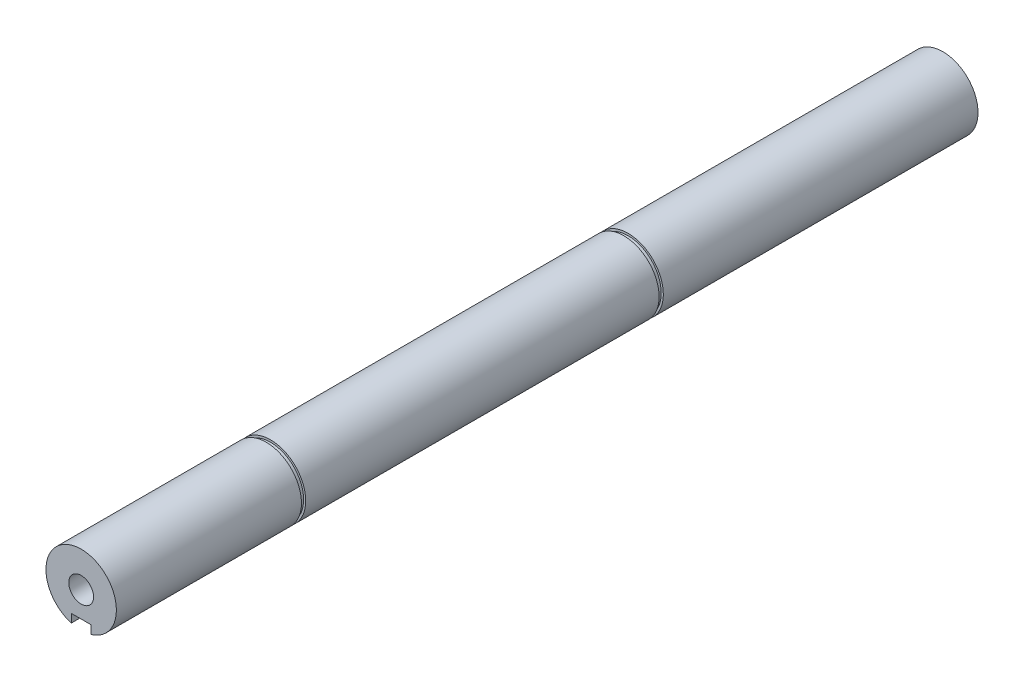
ISO-10303-21;
HEADER;
FILE_DESCRIPTION(('STEP AP214'),'2;1');
FILE_NAME('part.step','',(''),(''),'','','');
FILE_SCHEMA(('AUTOMOTIVE_DESIGN { 1 0 10303 214 1 1 1 1 }'));
ENDSEC;
DATA;
#1=APPLICATION_CONTEXT('core data for automotive mechanical design processes');
#2=APPLICATION_PROTOCOL_DEFINITION('international standard','automotive_design',2000,#1);
#3=PRODUCT_CONTEXT('',#1,'mechanical');
#4=PRODUCT('Part','Part','',(#3));
#5=PRODUCT_RELATED_PRODUCT_CATEGORY('part','',(#4));
#6=PRODUCT_DEFINITION_FORMATION('','',#4);
#7=PRODUCT_DEFINITION_CONTEXT('part definition',#1,'design');
#8=PRODUCT_DEFINITION('design','',#6,#7);
#9=PRODUCT_DEFINITION_SHAPE('','',#8);
#10=(LENGTH_UNIT() NAMED_UNIT(*) SI_UNIT(.MILLI.,.METRE.));
#11=(NAMED_UNIT(*) PLANE_ANGLE_UNIT() SI_UNIT($,.RADIAN.));
#12=(NAMED_UNIT(*) SI_UNIT($,.STERADIAN.) SOLID_ANGLE_UNIT());
#13=UNCERTAINTY_MEASURE_WITH_UNIT(LENGTH_MEASURE(1.E-05),#10,'distance_accuracy_value','');
#14=(GEOMETRIC_REPRESENTATION_CONTEXT(3) GLOBAL_UNCERTAINTY_ASSIGNED_CONTEXT((#13)) GLOBAL_UNIT_ASSIGNED_CONTEXT((#10,
#11,#12)) REPRESENTATION_CONTEXT('',''));
#15=CARTESIAN_POINT('',(0.,0.,0.));
#16=DIRECTION('',(0.,0.,1.));
#17=DIRECTION('',(1.,0.,0.));
#18=AXIS2_PLACEMENT_3D('',#15,#16,#17);
#19=CARTESIAN_POINT('',(0.,0.,0.));
#20=DIRECTION('',(0.,0.,0.999999999999996));
#21=DIRECTION('',(1.,0.,0.));
#22=AXIS2_PLACEMENT_3D('',#19,#20,#21);
#23=PLANE('',#22);
#24=CARTESIAN_POINT('',(0.,0.,0.));
#25=DIRECTION('',(0.,0.,0.999999999999996));
#26=DIRECTION('',(1.,0.,0.));
#27=AXIS2_PLACEMENT_3D('',#24,#25,#26);
#28=CIRCLE('',#27,4.39999999999999);
#29=CARTESIAN_POINT('',(4.39999999999999,0.,0.));
#30=VERTEX_POINT('',#29);
#31=EDGE_CURVE('E424',#30,#30,#28,.T.);
#32=ORIENTED_EDGE('',*,*,#31,.F.);
#33=EDGE_LOOP('',(#32));
#34=FACE_BOUND('',#33,.T.);
#35=DIRECTION('',(0.,-1.,0.));
#36=VECTOR('',#35,1.);
#37=CARTESIAN_POINT('',(-3.49999999999415,-9.00000000000115,0.));
#38=LINE('',#37,#36);
#39=CARTESIAN_POINT('',(-3.49999999999415,-9.00000000000115,0.));
#40=VERTEX_POINT('',#39);
#41=CARTESIAN_POINT('',(-3.49999999999417,-12.0000000000021,0.));
#42=VERTEX_POINT('',#41);
#43=EDGE_CURVE('E202',#40,#42,#38,.T.);
#44=ORIENTED_EDGE('',*,*,#43,.F.);
#45=DIRECTION('',(-1.,0.,0.));
#46=VECTOR('',#45,1.);
#47=CARTESIAN_POINT('',(3.49999999999429,-9.00000000000122,0.));
#48=LINE('',#47,#46);
#49=CARTESIAN_POINT('',(3.49999999999429,-9.00000000000122,0.));
#50=VERTEX_POINT('',#49);
#51=EDGE_CURVE('E199',#50,#40,#48,.T.);
#52=ORIENTED_EDGE('',*,*,#51,.F.);
#53=DIRECTION('',(0.,1.,0.));
#54=VECTOR('',#53,1.);
#55=CARTESIAN_POINT('',(3.49999999999415,-16.0000000000028,0.));
#56=LINE('',#55,#54);
#57=CARTESIAN_POINT('',(3.49999999999404,-12.0000000000019,0.));
#58=VERTEX_POINT('',#57);
#59=EDGE_CURVE('E184',#58,#50,#56,.T.);
#60=ORIENTED_EDGE('',*,*,#59,.F.);
#61=CARTESIAN_POINT('',(0.,0.,0.));
#62=DIRECTION('',(0.,0.,0.999999999999996));
#63=DIRECTION('',(1.,0.,0.));
#64=AXIS2_PLACEMENT_3D('',#61,#62,#63);
#65=CIRCLE('',#64,12.5);
#66=EDGE_CURVE('E210',#58,#42,#65,.T.);
#67=ORIENTED_EDGE('',*,*,#66,.T.);
#68=EDGE_LOOP('',(#44,#52,#60,#67));
#69=FACE_BOUND('',#68,.T.);
#70=ADVANCED_FACE('F52',(#34,#69),#23,.T.);
#71=CARTESIAN_POINT('',(0.,-1.11022302462516E-13,-341.191648507216));
#72=DIRECTION('',(0.,0.,0.999999999999996));
#73=DIRECTION('',(1.,0.,0.));
#74=AXIS2_PLACEMENT_3D('',#71,#72,#73);
#75=CYLINDRICAL_SURFACE('',#74,12.5);
#76=CARTESIAN_POINT('',(0.,0.,-65.7000000000001));
#77=DIRECTION('',(0.,0.,0.999999999999996));
#78=DIRECTION('',(1.,0.,0.));
#79=AXIS2_PLACEMENT_3D('',#76,#77,#78);
#80=CIRCLE('',#79,12.4999999999999);
#81=CARTESIAN_POINT('',(12.5,0.,-65.7000000000001));
#82=VERTEX_POINT('',#81);
#83=EDGE_CURVE('E402',#82,#82,#80,.T.);
#84=ORIENTED_EDGE('',*,*,#83,.T.);
#85=EDGE_LOOP('',(#84));
#86=FACE_BOUND('',#85,.T.);
#87=DIRECTION('',(0.,0.,0.999999999999996));
#88=VECTOR('',#87,1.);
#89=CARTESIAN_POINT('',(-3.49999999999398,-12.000000000002,-341.191648507216));
#90=LINE('',#89,#88);
#91=CARTESIAN_POINT('',(-3.49999999999417,-12.000000000002,-31.8000000000001));
#92=VERTEX_POINT('',#91);
#93=EDGE_CURVE('E157',#42,#92,#90,.F.);
#94=ORIENTED_EDGE('',*,*,#93,.F.);
#95=ORIENTED_EDGE('',*,*,#66,.F.);
#96=DIRECTION('',(0.,0.,0.999999999999996));
#97=VECTOR('',#96,1.);
#98=CARTESIAN_POINT('',(3.49999999999415,-12.0000000000018,-341.191648507216));
#99=LINE('',#98,#97);
#100=CARTESIAN_POINT('',(3.49999999999415,-12.0000000000017,-31.8000000000001));
#101=VERTEX_POINT('',#100);
#102=EDGE_CURVE('E160',#101,#58,#99,.T.);
#103=ORIENTED_EDGE('',*,*,#102,.F.);
#104=CARTESIAN_POINT('',(0.,0.,-31.8000000000001));
#105=DIRECTION('',(0.,0.,0.999999999999996));
#106=DIRECTION('',(1.,0.,0.));
#107=AXIS2_PLACEMENT_3D('',#104,#105,#106);
#108=CIRCLE('',#107,12.5);
#109=EDGE_CURVE('E214',#101,#92,#108,.F.);
#110=ORIENTED_EDGE('',*,*,#109,.T.);
#111=EDGE_LOOP('',(#94,#95,#103,#110));
#112=FACE_BOUND('',#111,.T.);
#113=ADVANCED_FACE('F228',(#86,#112),#75,.T.);
#114=CARTESIAN_POINT('',(-3.49999999999409,-9.00000000000109,-41.6994949366046));
#115=DIRECTION('',(-1.,0.,0.));
#116=DIRECTION('',(0.,0.,0.999999999999996));
#117=AXIS2_PLACEMENT_3D('',#114,#115,#116);
#118=PLANE('',#117);
#119=ORIENTED_EDGE('',*,*,#93,.T.);
#120=DIRECTION('',(0.,1.,0.));
#121=VECTOR('',#120,1.);
#122=CARTESIAN_POINT('',(-3.49999999999409,-9.00000000000109,-31.8000000000001));
#123=LINE('',#122,#121);
#124=CARTESIAN_POINT('',(-3.49999999999409,-9.00000000000109,-31.8000000000001));
#125=VERTEX_POINT('',#124);
#126=EDGE_CURVE('E75',#92,#125,#123,.T.);
#127=ORIENTED_EDGE('',*,*,#126,.T.);
#128=DIRECTION('',(0.,0.,0.999999999999996));
#129=VECTOR('',#128,1.);
#130=CARTESIAN_POINT('',(-3.49999999999409,-9.00000000000109,-41.6994949366046));
#131=LINE('',#130,#129);
#132=EDGE_CURVE('E195',#125,#40,#131,.T.);
#133=ORIENTED_EDGE('',*,*,#132,.T.);
#134=ORIENTED_EDGE('',*,*,#43,.T.);
#135=EDGE_LOOP('',(#119,#127,#133,#134));
#136=FACE_BOUND('',#135,.T.);
#137=ADVANCED_FACE('F230',(#136),#118,.F.);
#138=CARTESIAN_POINT('',(3.49999999999434,-9.00000000000123,-41.6994949366046));
#139=DIRECTION('',(0.,1.,0.));
#140=DIRECTION('',(0.,0.,0.999999999999996));
#141=AXIS2_PLACEMENT_3D('',#138,#139,#140);
#142=PLANE('',#141);
#143=DIRECTION('',(1.,0.,0.));
#144=VECTOR('',#143,1.);
#145=CARTESIAN_POINT('',(3.49999999999431,-9.0000000000012,-31.8000000000001));
#146=LINE('',#145,#144);
#147=CARTESIAN_POINT('',(3.49999999999431,-9.0000000000012,-31.8000000000001));
#148=VERTEX_POINT('',#147);
#149=EDGE_CURVE('E193',#125,#148,#146,.T.);
#150=ORIENTED_EDGE('',*,*,#149,.T.);
#151=DIRECTION('',(0.,0.,0.999999999999996));
#152=VECTOR('',#151,1.);
#153=CARTESIAN_POINT('',(3.49999999999434,-9.00000000000123,-41.6994949366046));
#154=LINE('',#153,#152);
#155=EDGE_CURVE('E204',#148,#50,#154,.T.);
#156=ORIENTED_EDGE('',*,*,#155,.T.);
#157=ORIENTED_EDGE('',*,*,#51,.T.);
#158=ORIENTED_EDGE('',*,*,#132,.F.);
#159=EDGE_LOOP('',(#150,#156,#157,#158));
#160=FACE_BOUND('',#159,.T.);
#161=ADVANCED_FACE('F233',(#160),#142,.F.);
#162=CARTESIAN_POINT('',(3.49999999999412,-16.0000000000028,-41.6994949366046));
#163=DIRECTION('',(1.,0.,0.));
#164=DIRECTION('',(0.,0.,-0.999999999999996));
#165=AXIS2_PLACEMENT_3D('',#162,#163,#164);
#166=PLANE('',#165);
#167=ORIENTED_EDGE('',*,*,#102,.T.);
#168=ORIENTED_EDGE('',*,*,#59,.T.);
#169=ORIENTED_EDGE('',*,*,#155,.F.);
#170=DIRECTION('',(0.,-1.,0.));
#171=VECTOR('',#170,1.);
#172=CARTESIAN_POINT('',(3.49999999999409,-16.0000000000029,-31.8000000000001));
#173=LINE('',#172,#171);
#174=EDGE_CURVE('E197',#148,#101,#173,.T.);
#175=ORIENTED_EDGE('',*,*,#174,.T.);
#176=EDGE_LOOP('',(#167,#168,#169,#175));
#177=FACE_BOUND('',#176,.T.);
#178=ADVANCED_FACE('F219',(#177),#166,.F.);
#179=CARTESIAN_POINT('',(1.74027459109993E-11,-12.5000000000011,-31.8000000000001));
#180=DIRECTION('',(0.,0.,0.999999999999996));
#181=DIRECTION('',(-1.,0.,0.));
#182=AXIS2_PLACEMENT_3D('',#179,#180,#181);
#183=PLANE('',#182);
#184=ORIENTED_EDGE('',*,*,#174,.F.);
#185=ORIENTED_EDGE('',*,*,#149,.F.);
#186=ORIENTED_EDGE('',*,*,#126,.F.);
#187=ORIENTED_EDGE('',*,*,#109,.F.);
#188=EDGE_LOOP('',(#184,#185,#186,#187));
#189=FACE_BOUND('',#188,.T.);
#190=ADVANCED_FACE('F234',(#189),#183,.T.);
#191=CARTESIAN_POINT('',(0.,0.,-26.25));
#192=DIRECTION('',(0.,0.,0.999999999999996));
#193=DIRECTION('',(1.,0.,0.));
#194=AXIS2_PLACEMENT_3D('',#191,#192,#193);
#195=CONICAL_SURFACE('',#194,4.39999999999999,1.02974425867665);
#196=CARTESIAN_POINT('',(0.,0.,-28.8937867237212));
#197=VERTEX_POINT('',#196);
#198=VERTEX_LOOP('',#197);
#199=FACE_BOUND('',#198,.T.);
#200=CARTESIAN_POINT('',(0.,0.,-26.25));
#201=DIRECTION('',(0.,0.,0.999999999999996));
#202=DIRECTION('',(1.,0.,0.));
#203=AXIS2_PLACEMENT_3D('',#200,#201,#202);
#204=CIRCLE('',#203,4.39999999999999);
#205=CARTESIAN_POINT('',(4.39999999999999,0.,-26.25));
#206=VERTEX_POINT('',#205);
#207=EDGE_CURVE('E180',#206,#206,#204,.T.);
#208=ORIENTED_EDGE('',*,*,#207,.T.);
#209=EDGE_LOOP('',(#208));
#210=FACE_BOUND('',#209,.T.);
#211=ADVANCED_FACE('F236',(#199,#210),#195,.F.);
#212=CARTESIAN_POINT('',(0.,0.,0.));
#213=DIRECTION('',(0.,0.,0.999999999999996));
#214=DIRECTION('',(1.,0.,0.));
#215=AXIS2_PLACEMENT_3D('',#212,#213,#214);
#216=CYLINDRICAL_SURFACE('',#215,4.39999999999999);
#217=ORIENTED_EDGE('',*,*,#207,.F.);
#218=EDGE_LOOP('',(#217));
#219=FACE_BOUND('',#218,.T.);
#220=ORIENTED_EDGE('',*,*,#31,.T.);
#221=EDGE_LOOP('',(#220));
#222=FACE_BOUND('',#221,.T.);
#223=ADVANCED_FACE('F242',(#219,#222),#216,.F.);
#224=CARTESIAN_POINT('',(0.,12.5,-67.2000000000001));
#225=DIRECTION('',(0.,0.,-0.999999999999996));
#226=DIRECTION('',(-1.,0.,0.));
#227=AXIS2_PLACEMENT_3D('',#224,#225,#226);
#228=PLANE('',#227);
#229=CARTESIAN_POINT('',(0.,0.,-67.2000000000001));
#230=DIRECTION('',(0.,0.,0.999999999999996));
#231=DIRECTION('',(1.,0.,0.));
#232=AXIS2_PLACEMENT_3D('',#229,#230,#231);
#233=CIRCLE('',#232,11.75);
#234=CARTESIAN_POINT('',(11.75,0.,-67.2000000000001));
#235=VERTEX_POINT('',#234);
#236=EDGE_CURVE('E407',#235,#235,#233,.T.);
#237=ORIENTED_EDGE('',*,*,#236,.F.);
#238=EDGE_LOOP('',(#237));
#239=FACE_BOUND('',#238,.T.);
#240=CARTESIAN_POINT('',(0.,0.,-67.2000000000001));
#241=DIRECTION('',(0.,0.,0.999999999999996));
#242=DIRECTION('',(1.,0.,0.));
#243=AXIS2_PLACEMENT_3D('',#240,#241,#242);
#244=CIRCLE('',#243,12.5);
#245=CARTESIAN_POINT('',(12.5,0.,-67.2000000000001));
#246=VERTEX_POINT('',#245);
#247=EDGE_CURVE('E399',#246,#246,#244,.T.);
#248=ORIENTED_EDGE('',*,*,#247,.T.);
#249=EDGE_LOOP('',(#248));
#250=FACE_BOUND('',#249,.T.);
#251=ADVANCED_FACE('F296',(#239,#250),#228,.F.);
#252=CARTESIAN_POINT('',(0.,-1.94289029309402E-13,999.999999999996));
#253=DIRECTION('',(0.,0.,0.999999999999996));
#254=DIRECTION('',(1.,0.,0.));
#255=AXIS2_PLACEMENT_3D('',#252,#253,#254);
#256=CYLINDRICAL_SURFACE('',#255,11.75);
#257=CARTESIAN_POINT('',(0.,0.,-65.7000000000001));
#258=DIRECTION('',(0.,0.,0.999999999999996));
#259=DIRECTION('',(1.,0.,0.));
#260=AXIS2_PLACEMENT_3D('',#257,#258,#259);
#261=CIRCLE('',#260,11.75);
#262=CARTESIAN_POINT('',(11.75,0.,-65.7000000000001));
#263=VERTEX_POINT('',#262);
#264=EDGE_CURVE('E410',#263,#263,#261,.T.);
#265=ORIENTED_EDGE('',*,*,#264,.F.);
#266=EDGE_LOOP('',(#265));
#267=FACE_BOUND('',#266,.T.);
#268=ORIENTED_EDGE('',*,*,#236,.T.);
#269=EDGE_LOOP('',(#268));
#270=FACE_BOUND('',#269,.T.);
#271=ADVANCED_FACE('F357',(#267,#270),#256,.T.);
#272=CARTESIAN_POINT('',(0.,11.75,-65.7000000000001));
#273=DIRECTION('',(0.,0.,0.999999999999996));
#274=DIRECTION('',(1.,0.,0.));
#275=AXIS2_PLACEMENT_3D('',#272,#273,#274);
#276=PLANE('',#275);
#277=ORIENTED_EDGE('',*,*,#83,.F.);
#278=EDGE_LOOP('',(#277));
#279=FACE_BOUND('',#278,.T.);
#280=ORIENTED_EDGE('',*,*,#264,.T.);
#281=EDGE_LOOP('',(#280));
#282=FACE_BOUND('',#281,.T.);
#283=ADVANCED_FACE('F348',(#279,#282),#276,.F.);
#284=ORIENTED_EDGE('',*,*,#247,.F.);
#285=EDGE_LOOP('',(#284));
#286=FACE_BOUND('',#285,.T.);
#287=CARTESIAN_POINT('',(1.94289029309402E-13,0.,-192.636309447889));
#288=DIRECTION('',(0.,0.,0.999999999999996));
#289=DIRECTION('',(1.,0.,0.));
#290=AXIS2_PLACEMENT_3D('',#287,#288,#289);
#291=CIRCLE('',#290,12.5);
#292=CARTESIAN_POINT('',(12.5000000000002,0.,-192.636309447889));
#293=VERTEX_POINT('',#292);
#294=EDGE_CURVE('E145',#293,#293,#291,.T.);
#295=ORIENTED_EDGE('',*,*,#294,.T.);
#296=EDGE_LOOP('',(#295));
#297=FACE_BOUND('',#296,.T.);
#298=ADVANCED_FACE('F255',(#286,#297),#75,.T.);
#299=CARTESIAN_POINT('',(0.,11.75,-194.136309447889));
#300=DIRECTION('',(0.,0.,0.999999999999996));
#301=DIRECTION('',(1.,0.,0.));
#302=AXIS2_PLACEMENT_3D('',#299,#300,#301);
#303=PLANE('',#302);
#304=DIRECTION('',(0.,-1.,0.));
#305=VECTOR('',#304,1.);
#306=CARTESIAN_POINT('',(3.49999999999431,-9.00000000000119,-194.136309447889));
#307=LINE('',#306,#305);
#308=CARTESIAN_POINT('',(3.4999999999942,-11.2166171370894,-194.136309447889));
#309=VERTEX_POINT('',#308);
#310=CARTESIAN_POINT('',(3.49999999999412,-12.0000000000018,-194.136309447889));
#311=VERTEX_POINT('',#310);
#312=EDGE_CURVE('E139',#309,#311,#307,.T.);
#313=ORIENTED_EDGE('',*,*,#312,.T.);
#314=CARTESIAN_POINT('',(1.94289029309402E-13,0.,-194.136309447889));
#315=DIRECTION('',(0.,0.,0.999999999999996));
#316=DIRECTION('',(1.,0.,0.));
#317=AXIS2_PLACEMENT_3D('',#314,#315,#316);
#318=CIRCLE('',#317,12.4999999999999);
#319=CARTESIAN_POINT('',(-3.49999999999415,-12.0000000000019,-194.136309447889));
#320=VERTEX_POINT('',#319);
#321=EDGE_CURVE('E134',#311,#320,#318,.T.);
#322=ORIENTED_EDGE('',*,*,#321,.T.);
#323=DIRECTION('',(0.,1.,0.));
#324=VECTOR('',#323,1.);
#325=CARTESIAN_POINT('',(-3.49999999999401,-16.0000000000028,-194.136309447889));
#326=LINE('',#325,#324);
#327=CARTESIAN_POINT('',(-3.49999999999412,-11.2166171370891,-194.136309447889));
#328=VERTEX_POINT('',#327);
#329=EDGE_CURVE('E13',#320,#328,#326,.T.);
#330=ORIENTED_EDGE('',*,*,#329,.T.);
#331=CARTESIAN_POINT('',(1.94289029309402E-13,0.,-194.136309447889));
#332=DIRECTION('',(0.,0.,0.999999999999996));
#333=DIRECTION('',(1.,0.,0.));
#334=AXIS2_PLACEMENT_3D('',#331,#332,#333);
#335=CIRCLE('',#334,11.75);
#336=EDGE_CURVE('E144',#309,#328,#335,.T.);
#337=ORIENTED_EDGE('',*,*,#336,.F.);
#338=EDGE_LOOP('',(#313,#322,#330,#337));
#339=FACE_BOUND('',#338,.T.);
#340=ADVANCED_FACE('F136',(#339),#303,.T.);
#341=CARTESIAN_POINT('',(0.,-1.94289029309402E-13,999.999999999996));
#342=DIRECTION('',(0.,0.,0.999999999999996));
#343=DIRECTION('',(1.,0.,0.));
#344=AXIS2_PLACEMENT_3D('',#341,#342,#343);
#345=CYLINDRICAL_SURFACE('',#344,11.75);
#346=CARTESIAN_POINT('',(1.94289029309402E-13,0.,-192.636309447889));
#347=DIRECTION('',(0.,0.,0.999999999999996));
#348=DIRECTION('',(1.,0.,0.));
#349=AXIS2_PLACEMENT_3D('',#346,#347,#348);
#350=CIRCLE('',#349,11.75);
#351=CARTESIAN_POINT('',(11.7500000000002,0.,-192.636309447889));
#352=VERTEX_POINT('',#351);
#353=EDGE_CURVE('E395',#352,#352,#350,.T.);
#354=ORIENTED_EDGE('',*,*,#353,.F.);
#355=EDGE_LOOP('',(#354));
#356=FACE_BOUND('',#355,.T.);
#357=DIRECTION('',(0.,0.,0.999999999999996));
#358=VECTOR('',#357,1.);
#359=CARTESIAN_POINT('',(3.49999999999429,-11.2166171370894,999.999999999996));
#360=LINE('',#359,#358);
#361=CARTESIAN_POINT('',(3.4999999999942,-11.2166171370894,-193.836309447889));
#362=VERTEX_POINT('',#361);
#363=EDGE_CURVE('E416',#362,#309,#360,.F.);
#364=ORIENTED_EDGE('',*,*,#363,.T.);
#365=ORIENTED_EDGE('',*,*,#336,.T.);
#366=DIRECTION('',(0.,0.,0.999999999999996));
#367=VECTOR('',#366,1.);
#368=CARTESIAN_POINT('',(-3.49999999999404,-11.2166171370894,999.999999999996));
#369=LINE('',#368,#367);
#370=CARTESIAN_POINT('',(-3.49999999999412,-11.2166171370891,-193.836309447889));
#371=VERTEX_POINT('',#370);
#372=EDGE_CURVE('E67',#328,#371,#369,.T.);
#373=ORIENTED_EDGE('',*,*,#372,.T.);
#374=CARTESIAN_POINT('',(1.94289029309402E-13,0.,-193.836309447889));
#375=DIRECTION('',(0.,0.,-0.999999999999996));
#376=DIRECTION('',(0.,1.,0.));
#377=AXIS2_PLACEMENT_3D('',#374,#375,#376);
#378=CIRCLE('',#377,11.75);
#379=EDGE_CURVE('E60',#362,#371,#378,.T.);
#380=ORIENTED_EDGE('',*,*,#379,.F.);
#381=EDGE_LOOP('',(#364,#365,#373,#380));
#382=FACE_BOUND('',#381,.T.);
#383=ADVANCED_FACE('F377',(#356,#382),#345,.T.);
#384=CARTESIAN_POINT('',(0.,12.5,-192.636309447889));
#385=DIRECTION('',(0.,0.,-0.999999999999996));
#386=DIRECTION('',(-1.,0.,0.));
#387=AXIS2_PLACEMENT_3D('',#384,#385,#386);
#388=PLANE('',#387);
#389=ORIENTED_EDGE('',*,*,#353,.T.);
#390=EDGE_LOOP('',(#389));
#391=FACE_BOUND('',#390,.T.);
#392=ORIENTED_EDGE('',*,*,#294,.F.);
#393=EDGE_LOOP('',(#392));
#394=FACE_BOUND('',#393,.T.);
#395=ADVANCED_FACE('F308',(#391,#394),#388,.T.);
#396=CARTESIAN_POINT('',(0.,-1.11022302462516E-13,-279.586309447888));
#397=DIRECTION('',(0.,0.,-0.999999999999996));
#398=DIRECTION('',(0.,1.,0.));
#399=AXIS2_PLACEMENT_3D('',#396,#397,#398);
#400=CONICAL_SURFACE('',#399,4.39999999999999,1.02974425867666);
#401=CARTESIAN_POINT('',(0.,-1.11022302462516E-13,-276.942522724167));
#402=VERTEX_POINT('',#401);
#403=VERTEX_LOOP('',#402);
#404=FACE_BOUND('',#403,.T.);
#405=CARTESIAN_POINT('',(0.,-1.11022302462516E-13,-279.586309447888));
#406=DIRECTION('',(0.,0.,-0.999999999999996));
#407=DIRECTION('',(0.,1.,0.));
#408=AXIS2_PLACEMENT_3D('',#405,#406,#407);
#409=CIRCLE('',#408,4.39999999999999);
#410=CARTESIAN_POINT('',(0.,4.39999999999989,-279.586309447888));
#411=VERTEX_POINT('',#410);
#412=EDGE_CURVE('E422',#411,#411,#409,.T.);
#413=ORIENTED_EDGE('',*,*,#412,.T.);
#414=EDGE_LOOP('',(#413));
#415=FACE_BOUND('',#414,.T.);
#416=ADVANCED_FACE('F302',(#404,#415),#400,.F.);
#417=CARTESIAN_POINT('',(0.,-1.11022302462516E-13,-305.836309447888));
#418=DIRECTION('',(0.,0.,-0.999999999999996));
#419=DIRECTION('',(0.,1.,0.));
#420=AXIS2_PLACEMENT_3D('',#417,#418,#419);
#421=CYLINDRICAL_SURFACE('',#420,4.39999999999999);
#422=ORIENTED_EDGE('',*,*,#412,.F.);
#423=EDGE_LOOP('',(#422));
#424=FACE_BOUND('',#423,.T.);
#425=CARTESIAN_POINT('',(0.,-1.11022302462516E-13,-305.836309447888));
#426=DIRECTION('',(0.,0.,-0.999999999999996));
#427=DIRECTION('',(0.,1.,0.));
#428=AXIS2_PLACEMENT_3D('',#425,#426,#427);
#429=CIRCLE('',#428,4.39999999999999);
#430=CARTESIAN_POINT('',(0.,4.39999999999989,-305.836309447888));
#431=VERTEX_POINT('',#430);
#432=EDGE_CURVE('E419',#431,#431,#429,.T.);
#433=ORIENTED_EDGE('',*,*,#432,.T.);
#434=EDGE_LOOP('',(#433));
#435=FACE_BOUND('',#434,.T.);
#436=ADVANCED_FACE('F307',(#424,#435),#421,.F.);
#437=CARTESIAN_POINT('',(1.74027459109993E-11,-4.9960036108132E-13,-305.836309447888));
#438=DIRECTION('',(0.,0.,-0.999999999999996));
#439=DIRECTION('',(0.262210136966452,0.965010799976891,0.));
#440=AXIS2_PLACEMENT_3D('',#437,#438,#439);
#441=PLANE('',#440);
#442=ORIENTED_EDGE('',*,*,#432,.F.);
#443=EDGE_LOOP('',(#442));
#444=FACE_BOUND('',#443,.T.);
#445=DIRECTION('',(0.,-1.,0.));
#446=VECTOR('',#445,1.);
#447=CARTESIAN_POINT('',(3.49999999999429,-9.00000000000124,-305.836309447888));
#448=LINE('',#447,#446);
#449=CARTESIAN_POINT('',(3.49999999999429,-9.00000000000124,-305.836309447888));
#450=VERTEX_POINT('',#449);
#451=CARTESIAN_POINT('',(3.49999999999417,-12.000000000002,-305.836309447888));
#452=VERTEX_POINT('',#451);
#453=EDGE_CURVE('E185',#450,#452,#448,.T.);
#454=ORIENTED_EDGE('',*,*,#453,.F.);
#455=DIRECTION('',(1.,0.,0.));
#456=VECTOR('',#455,1.);
#457=CARTESIAN_POINT('',(-3.49999999999415,-9.00000000000115,-305.836309447888));
#458=LINE('',#457,#456);
#459=CARTESIAN_POINT('',(-3.49999999999415,-9.00000000000115,-305.836309447888));
#460=VERTEX_POINT('',#459);
#461=EDGE_CURVE('E189',#460,#450,#458,.T.);
#462=ORIENTED_EDGE('',*,*,#461,.F.);
#463=DIRECTION('',(0.,1.,0.));
#464=VECTOR('',#463,1.);
#465=CARTESIAN_POINT('',(-3.49999999999409,-16.000000000003,-305.836309447888));
#466=LINE('',#465,#464);
#467=CARTESIAN_POINT('',(-3.49999999999412,-12.0000000000021,-305.836309447888));
#468=VERTEX_POINT('',#467);
#469=EDGE_CURVE('E187',#468,#460,#466,.T.);
#470=ORIENTED_EDGE('',*,*,#469,.F.);
#471=CARTESIAN_POINT('',(0.,-1.11022302462516E-13,-305.836309447888));
#472=DIRECTION('',(0.,0.,-0.999999999999996));
#473=DIRECTION('',(0.,1.,0.));
#474=AXIS2_PLACEMENT_3D('',#471,#472,#473);
#475=CIRCLE('',#474,12.5);
#476=EDGE_CURVE('E155',#452,#468,#475,.F.);
#477=ORIENTED_EDGE('',*,*,#476,.F.);
#478=EDGE_LOOP('',(#454,#462,#470,#477));
#479=FACE_BOUND('',#478,.T.);
#480=ADVANCED_FACE('F54',(#444,#479),#441,.T.);
#481=CARTESIAN_POINT('',(-3.49999999999415,-9.00000000000105,-183.936814511285));
#482=DIRECTION('',(0.,1.,0.));
#483=DIRECTION('',(0.,0.,0.999999999999996));
#484=AXIS2_PLACEMENT_3D('',#481,#482,#483);
#485=PLANE('',#484);
#486=DIRECTION('',(-1.,0.,0.));
#487=VECTOR('',#486,1.);
#488=CARTESIAN_POINT('',(-3.49999999999415,-9.00000000000105,-193.836309447889));
#489=LINE('',#488,#487);
#490=CARTESIAN_POINT('',(3.49999999999431,-9.00000000000119,-193.836309447889));
#491=VERTEX_POINT('',#490);
#492=CARTESIAN_POINT('',(-3.49999999999415,-9.00000000000105,-193.836309447889));
#493=VERTEX_POINT('',#492);
#494=EDGE_CURVE('E174',#491,#493,#489,.T.);
#495=ORIENTED_EDGE('',*,*,#494,.T.);
#496=DIRECTION('',(0.,0.,-0.999999999999996));
#497=VECTOR('',#496,1.);
#498=CARTESIAN_POINT('',(-3.49999999999415,-9.00000000000105,-183.936814511285));
#499=LINE('',#498,#497);
#500=EDGE_CURVE('E173',#493,#460,#499,.T.);
#501=ORIENTED_EDGE('',*,*,#500,.T.);
#502=ORIENTED_EDGE('',*,*,#461,.T.);
#503=DIRECTION('',(0.,0.,-0.999999999999996));
#504=VECTOR('',#503,1.);
#505=CARTESIAN_POINT('',(3.49999999999431,-9.00000000000119,-183.936814511285));
#506=LINE('',#505,#504);
#507=EDGE_CURVE('E175',#491,#450,#506,.T.);
#508=ORIENTED_EDGE('',*,*,#507,.F.);
#509=EDGE_LOOP('',(#495,#501,#502,#508));
#510=FACE_BOUND('',#509,.T.);
#511=ADVANCED_FACE('F277',(#510),#485,.F.);
#512=CARTESIAN_POINT('',(1.74582570622306E-11,-3.33066907387547E-13,-193.836309447889));
#513=DIRECTION('',(0.,0.,-0.999999999999996));
#514=DIRECTION('',(0.262210136966452,0.965010799976891,0.));
#515=AXIS2_PLACEMENT_3D('',#512,#513,#514);
#516=PLANE('',#515);
#517=DIRECTION('',(0.,1.,0.));
#518=VECTOR('',#517,1.);
#519=CARTESIAN_POINT('',(3.49999999999431,-9.00000000000119,-193.836309447889));
#520=LINE('',#519,#518);
#521=EDGE_CURVE('E170',#362,#491,#520,.T.);
#522=ORIENTED_EDGE('',*,*,#521,.F.);
#523=ORIENTED_EDGE('',*,*,#379,.T.);
#524=DIRECTION('',(0.,-1.,0.));
#525=VECTOR('',#524,1.);
#526=CARTESIAN_POINT('',(-3.49999999999401,-16.0000000000028,-193.836309447889));
#527=LINE('',#526,#525);
#528=EDGE_CURVE('E168',#493,#371,#527,.T.);
#529=ORIENTED_EDGE('',*,*,#528,.F.);
#530=ORIENTED_EDGE('',*,*,#494,.F.);
#531=EDGE_LOOP('',(#522,#523,#529,#530));
#532=FACE_BOUND('',#531,.T.);
#533=ADVANCED_FACE('F166',(#532),#516,.T.);
#534=CARTESIAN_POINT('',(-3.49999999999404,-16.0000000000029,-183.936814511285));
#535=DIRECTION('',(-1.,0.,0.));
#536=DIRECTION('',(0.,0.,0.999999999999996));
#537=AXIS2_PLACEMENT_3D('',#534,#535,#536);
#538=PLANE('',#537);
#539=ORIENTED_EDGE('',*,*,#372,.F.);
#540=ORIENTED_EDGE('',*,*,#329,.F.);
#541=DIRECTION('',(0.,0.,0.999999999999996));
#542=VECTOR('',#541,1.);
#543=CARTESIAN_POINT('',(-3.49999999999398,-12.000000000002,-341.191648507216));
#544=LINE('',#543,#542);
#545=EDGE_CURVE('E149',#320,#468,#544,.F.);
#546=ORIENTED_EDGE('',*,*,#545,.T.);
#547=ORIENTED_EDGE('',*,*,#469,.T.);
#548=ORIENTED_EDGE('',*,*,#500,.F.);
#549=ORIENTED_EDGE('',*,*,#528,.T.);
#550=EDGE_LOOP('',(#539,#540,#546,#547,#548,#549));
#551=FACE_BOUND('',#550,.T.);
#552=ADVANCED_FACE('F148',(#551),#538,.F.);
#553=CARTESIAN_POINT('',(3.49999999999431,-9.00000000000119,-183.936814511285));
#554=DIRECTION('',(1.,0.,0.));
#555=DIRECTION('',(0.,0.,-0.999999999999996));
#556=AXIS2_PLACEMENT_3D('',#553,#554,#555);
#557=PLANE('',#556);
#558=ORIENTED_EDGE('',*,*,#363,.F.);
#559=ORIENTED_EDGE('',*,*,#521,.T.);
#560=ORIENTED_EDGE('',*,*,#507,.T.);
#561=ORIENTED_EDGE('',*,*,#453,.T.);
#562=DIRECTION('',(0.,0.,0.999999999999996));
#563=VECTOR('',#562,1.);
#564=CARTESIAN_POINT('',(3.49999999999415,-12.0000000000018,-341.191648507216));
#565=LINE('',#564,#563);
#566=EDGE_CURVE('E156',#452,#311,#565,.T.);
#567=ORIENTED_EDGE('',*,*,#566,.T.);
#568=ORIENTED_EDGE('',*,*,#312,.F.);
#569=EDGE_LOOP('',(#558,#559,#560,#561,#567,#568));
#570=FACE_BOUND('',#569,.T.);
#571=ADVANCED_FACE('F330',(#570),#557,.F.);
#572=ORIENTED_EDGE('',*,*,#545,.F.);
#573=ORIENTED_EDGE('',*,*,#321,.F.);
#574=ORIENTED_EDGE('',*,*,#566,.F.);
#575=ORIENTED_EDGE('',*,*,#476,.T.);
#576=EDGE_LOOP('',(#572,#573,#574,#575));
#577=FACE_BOUND('',#576,.T.);
#578=ADVANCED_FACE('F153',(#577),#75,.T.);
#579=CLOSED_SHELL('',(#70,#113,#137,#161,#178,#190,#211,#223,#251,#271,#283,#298,#340,#383,#395,
#416,#436,#480,#511,#533,#552,#571,#578));
#580=MANIFOLD_SOLID_BREP('B2',#579);
#581=ADVANCED_BREP_SHAPE_REPRESENTATION('',(#18,#580),#14);
#582=SHAPE_DEFINITION_REPRESENTATION(#9,#581);
ENDSEC;
END-ISO-10303-21;
